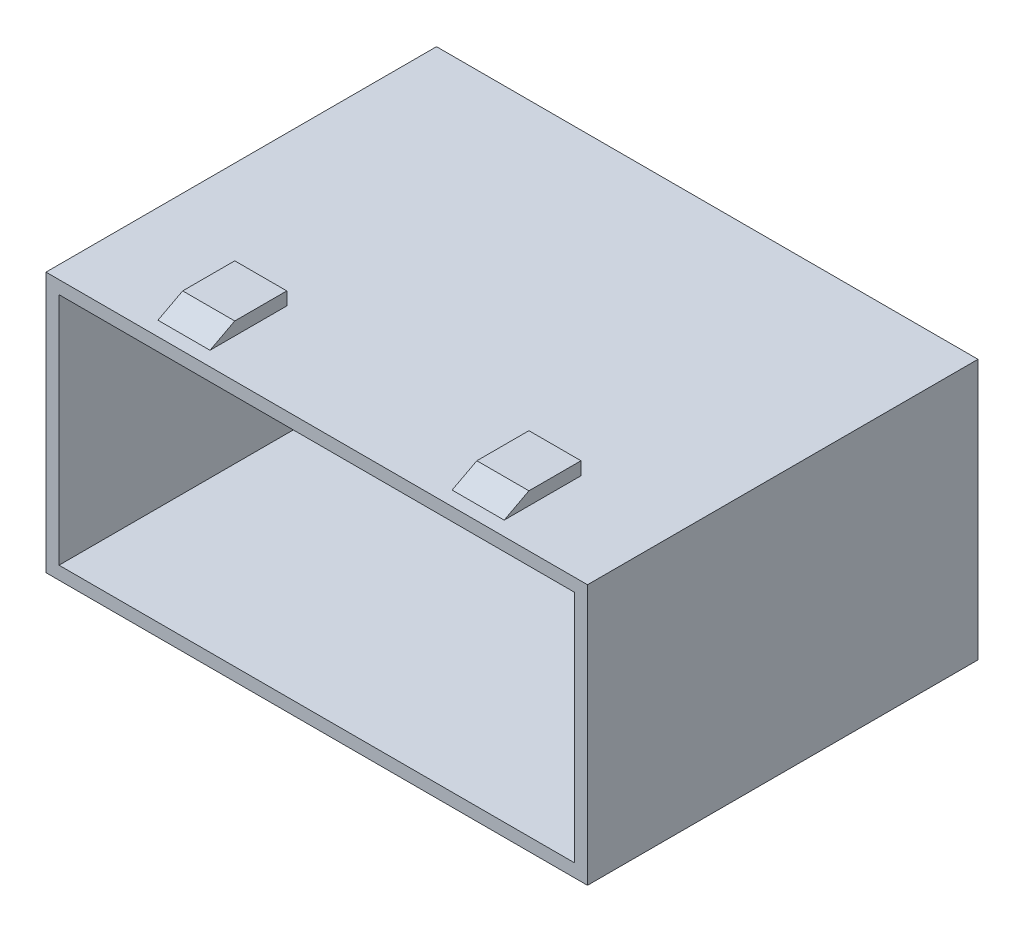
ISO-10303-21;
HEADER;
FILE_DESCRIPTION(('STEP AP214'),'2;1');
FILE_NAME('part.step','',(''),(''),'','','');
FILE_SCHEMA(('AUTOMOTIVE_DESIGN { 1 0 10303 214 1 1 1 1 }'));
ENDSEC;
DATA;
#1=APPLICATION_CONTEXT('core data for automotive mechanical design processes');
#2=APPLICATION_PROTOCOL_DEFINITION('international standard','automotive_design',2000,#1);
#3=PRODUCT_CONTEXT('',#1,'mechanical');
#4=PRODUCT('Part','Part','',(#3));
#5=PRODUCT_RELATED_PRODUCT_CATEGORY('part','',(#4));
#6=PRODUCT_DEFINITION_FORMATION('','',#4);
#7=PRODUCT_DEFINITION_CONTEXT('part definition',#1,'design');
#8=PRODUCT_DEFINITION('design','',#6,#7);
#9=PRODUCT_DEFINITION_SHAPE('','',#8);
#10=(LENGTH_UNIT() NAMED_UNIT(*) SI_UNIT(.MILLI.,.METRE.));
#11=(NAMED_UNIT(*) PLANE_ANGLE_UNIT() SI_UNIT($,.RADIAN.));
#12=(NAMED_UNIT(*) SI_UNIT($,.STERADIAN.) SOLID_ANGLE_UNIT());
#13=UNCERTAINTY_MEASURE_WITH_UNIT(LENGTH_MEASURE(1.E-05),#10,'distance_accuracy_value','');
#14=(GEOMETRIC_REPRESENTATION_CONTEXT(3) GLOBAL_UNCERTAINTY_ASSIGNED_CONTEXT((#13)) GLOBAL_UNIT_ASSIGNED_CONTEXT((#10,
#11,#12)) REPRESENTATION_CONTEXT('',''));
#15=CARTESIAN_POINT('',(0.,0.,0.));
#16=DIRECTION('',(0.,0.,1.));
#17=DIRECTION('',(1.,0.,0.));
#18=AXIS2_PLACEMENT_3D('',#15,#16,#17);
#19=CARTESIAN_POINT('',(13.3,11.,0.));
#20=DIRECTION('',(-1.,0.,0.));
#21=DIRECTION('',(0.,0.,1.));
#22=AXIS2_PLACEMENT_3D('',#19,#20,#21);
#23=PLANE('',#22);
#24=DIRECTION('',(0.,0.,-1.));
#25=VECTOR('',#24,1.);
#26=CARTESIAN_POINT('',(13.3,10.,0.));
#27=LINE('',#26,#25);
#28=CARTESIAN_POINT('',(13.3,10.,8.90014924755403));
#29=VERTEX_POINT('',#28);
#30=CARTESIAN_POINT('',(13.3,10.,3.00000000000001));
#31=VERTEX_POINT('',#30);
#32=EDGE_CURVE('E39',#29,#31,#27,.T.);
#33=ORIENTED_EDGE('',*,*,#32,.T.);
#34=DIRECTION('',(0.,-1.,0.));
#35=VECTOR('',#34,1.);
#36=CARTESIAN_POINT('',(13.3,0.,3.00000000000001));
#37=LINE('',#36,#35);
#38=CARTESIAN_POINT('',(13.3,11.,3.00000000000001));
#39=VERTEX_POINT('',#38);
#40=EDGE_CURVE('E53',#39,#31,#37,.T.);
#41=ORIENTED_EDGE('',*,*,#40,.F.);
#42=DIRECTION('',(0.,0.,-1.));
#43=VECTOR('',#42,1.);
#44=CARTESIAN_POINT('',(13.3,11.,0.));
#45=LINE('',#44,#43);
#46=CARTESIAN_POINT('',(13.3,11.,6.99999999999999));
#47=VERTEX_POINT('',#46);
#48=EDGE_CURVE('E281',#47,#39,#45,.T.);
#49=ORIENTED_EDGE('',*,*,#48,.F.);
#50=DIRECTION('',(0.,-0.465717785352861,0.884933299410767));
#51=VECTOR('',#50,1.);
#52=CARTESIAN_POINT('',(13.3,11.4990806231724,6.05167232941022));
#53=LINE('',#52,#51);
#54=EDGE_CURVE('E61',#47,#29,#53,.T.);
#55=ORIENTED_EDGE('',*,*,#54,.T.);
#56=EDGE_LOOP('',(#33,#41,#49,#55));
#57=FACE_BOUND('',#56,.T.);
#58=ADVANCED_FACE('F35',(#57),#23,.F.);
#59=CARTESIAN_POINT('',(9.3,11.,0.));
#60=DIRECTION('',(-1.,0.,0.));
#61=DIRECTION('',(0.,0.,1.));
#62=AXIS2_PLACEMENT_3D('',#59,#60,#61);
#63=PLANE('',#62);
#64=DIRECTION('',(0.,1.,0.));
#65=VECTOR('',#64,1.);
#66=CARTESIAN_POINT('',(9.3,11.,3.00000000000001));
#67=LINE('',#66,#65);
#68=CARTESIAN_POINT('',(9.3,10.,3.00000000000001));
#69=VERTEX_POINT('',#68);
#70=CARTESIAN_POINT('',(9.3,11.,3.00000000000001));
#71=VERTEX_POINT('',#70);
#72=EDGE_CURVE('E253',#69,#71,#67,.T.);
#73=ORIENTED_EDGE('',*,*,#72,.F.);
#74=DIRECTION('',(0.,0.,-1.));
#75=VECTOR('',#74,1.);
#76=CARTESIAN_POINT('',(9.3,10.,0.));
#77=LINE('',#76,#75);
#78=CARTESIAN_POINT('',(9.3,10.,8.90014924755403));
#79=VERTEX_POINT('',#78);
#80=EDGE_CURVE('E285',#79,#69,#77,.T.);
#81=ORIENTED_EDGE('',*,*,#80,.F.);
#82=DIRECTION('',(0.,0.465717785352861,-0.884933299410767));
#83=VECTOR('',#82,1.);
#84=CARTESIAN_POINT('',(9.3,13.8849042347061,1.51825138915781));
#85=LINE('',#84,#83);
#86=CARTESIAN_POINT('',(9.3,11.,6.99999999999999));
#87=VERTEX_POINT('',#86);
#88=EDGE_CURVE('E266',#79,#87,#85,.T.);
#89=ORIENTED_EDGE('',*,*,#88,.T.);
#90=DIRECTION('',(0.,0.,-1.));
#91=VECTOR('',#90,1.);
#92=CARTESIAN_POINT('',(9.3,11.,0.));
#93=LINE('',#92,#91);
#94=EDGE_CURVE('E284',#87,#71,#93,.T.);
#95=ORIENTED_EDGE('',*,*,#94,.T.);
#96=EDGE_LOOP('',(#73,#81,#89,#95));
#97=FACE_BOUND('',#96,.T.);
#98=ADVANCED_FACE('F447',(#97),#63,.T.);
#99=CARTESIAN_POINT('',(0.,11.,0.));
#100=DIRECTION('',(0.,1.,0.));
#101=DIRECTION('',(0.,0.,1.));
#102=AXIS2_PLACEMENT_3D('',#99,#100,#101);
#103=PLANE('',#102);
#104=DIRECTION('',(1.,0.,0.));
#105=VECTOR('',#104,1.);
#106=CARTESIAN_POINT('',(-13.7,11.,3.00000000000001));
#107=LINE('',#106,#105);
#108=EDGE_CURVE('E242',#71,#39,#107,.T.);
#109=ORIENTED_EDGE('',*,*,#108,.F.);
#110=ORIENTED_EDGE('',*,*,#94,.F.);
#111=DIRECTION('',(1.,0.,0.));
#112=VECTOR('',#111,1.);
#113=CARTESIAN_POINT('',(-13.7,11.,6.99999999999999));
#114=LINE('',#113,#112);
#115=EDGE_CURVE('E256',#87,#47,#114,.T.);
#116=ORIENTED_EDGE('',*,*,#115,.T.);
#117=ORIENTED_EDGE('',*,*,#48,.T.);
#118=EDGE_LOOP('',(#109,#110,#116,#117));
#119=FACE_BOUND('',#118,.T.);
#120=ADVANCED_FACE('F452',(#119),#103,.T.);
#121=CARTESIAN_POINT('',(-13.3,11.,0.));
#122=DIRECTION('',(-1.,0.,0.));
#123=DIRECTION('',(0.,0.,1.));
#124=AXIS2_PLACEMENT_3D('',#121,#122,#123);
#125=PLANE('',#124);
#126=DIRECTION('',(0.,1.,0.));
#127=VECTOR('',#126,1.);
#128=CARTESIAN_POINT('',(-13.3,11.,3.00000000000001));
#129=LINE('',#128,#127);
#130=CARTESIAN_POINT('',(-13.3,10.,3.00000000000001));
#131=VERTEX_POINT('',#130);
#132=CARTESIAN_POINT('',(-13.3,11.,3.00000000000001));
#133=VERTEX_POINT('',#132);
#134=EDGE_CURVE('E251',#131,#133,#129,.T.);
#135=ORIENTED_EDGE('',*,*,#134,.F.);
#136=DIRECTION('',(0.,0.,-1.));
#137=VECTOR('',#136,1.);
#138=CARTESIAN_POINT('',(-13.3,10.,0.));
#139=LINE('',#138,#137);
#140=CARTESIAN_POINT('',(-13.3,10.,8.90014924755403));
#141=VERTEX_POINT('',#140);
#142=EDGE_CURVE('E269',#141,#131,#139,.T.);
#143=ORIENTED_EDGE('',*,*,#142,.F.);
#144=DIRECTION('',(0.,0.465717785352861,-0.884933299410767));
#145=VECTOR('',#144,1.);
#146=CARTESIAN_POINT('',(-13.3,13.8849042347061,1.51825138915781));
#147=LINE('',#146,#145);
#148=CARTESIAN_POINT('',(-13.3,11.,6.99999999999999));
#149=VERTEX_POINT('',#148);
#150=EDGE_CURVE('E263',#141,#149,#147,.T.);
#151=ORIENTED_EDGE('',*,*,#150,.T.);
#152=DIRECTION('',(0.,0.,-1.));
#153=VECTOR('',#152,1.);
#154=CARTESIAN_POINT('',(-13.3,11.,0.));
#155=LINE('',#154,#153);
#156=EDGE_CURVE('E270',#149,#133,#155,.T.);
#157=ORIENTED_EDGE('',*,*,#156,.T.);
#158=EDGE_LOOP('',(#135,#143,#151,#157));
#159=FACE_BOUND('',#158,.T.);
#160=ADVANCED_FACE('F459',(#159),#125,.T.);
#161=CARTESIAN_POINT('',(-9.3,11.,0.));
#162=DIRECTION('',(-1.,0.,0.));
#163=DIRECTION('',(0.,0.,1.));
#164=AXIS2_PLACEMENT_3D('',#161,#162,#163);
#165=PLANE('',#164);
#166=DIRECTION('',(0.,0.,-1.));
#167=VECTOR('',#166,1.);
#168=CARTESIAN_POINT('',(-9.3,10.,0.));
#169=LINE('',#168,#167);
#170=CARTESIAN_POINT('',(-9.3,10.,8.90014924755403));
#171=VERTEX_POINT('',#170);
#172=CARTESIAN_POINT('',(-9.3,10.,3.00000000000001));
#173=VERTEX_POINT('',#172);
#174=EDGE_CURVE('E274',#171,#173,#169,.T.);
#175=ORIENTED_EDGE('',*,*,#174,.T.);
#176=DIRECTION('',(0.,1.,0.));
#177=VECTOR('',#176,1.);
#178=CARTESIAN_POINT('',(-9.3,11.,3.00000000000001));
#179=LINE('',#178,#177);
#180=CARTESIAN_POINT('',(-9.3,11.,3.00000000000001));
#181=VERTEX_POINT('',#180);
#182=EDGE_CURVE('E248',#173,#181,#179,.T.);
#183=ORIENTED_EDGE('',*,*,#182,.T.);
#184=DIRECTION('',(0.,0.,-1.));
#185=VECTOR('',#184,1.);
#186=CARTESIAN_POINT('',(-9.3,11.,0.));
#187=LINE('',#186,#185);
#188=CARTESIAN_POINT('',(-9.3,11.,6.99999999999999));
#189=VERTEX_POINT('',#188);
#190=EDGE_CURVE('E273',#189,#181,#187,.T.);
#191=ORIENTED_EDGE('',*,*,#190,.F.);
#192=DIRECTION('',(0.,0.465717785352861,-0.884933299410767));
#193=VECTOR('',#192,1.);
#194=CARTESIAN_POINT('',(-9.3,13.8849042347061,1.51825138915781));
#195=LINE('',#194,#193);
#196=EDGE_CURVE('E261',#171,#189,#195,.T.);
#197=ORIENTED_EDGE('',*,*,#196,.F.);
#198=EDGE_LOOP('',(#175,#183,#191,#197));
#199=FACE_BOUND('',#198,.T.);
#200=ADVANCED_FACE('F463',(#199),#165,.F.);
#201=CARTESIAN_POINT('',(0.,11.,0.));
#202=DIRECTION('',(0.,1.,0.));
#203=DIRECTION('',(0.,0.,1.));
#204=AXIS2_PLACEMENT_3D('',#201,#202,#203);
#205=PLANE('',#204);
#206=EDGE_CURVE('E246',#133,#181,#107,.T.);
#207=ORIENTED_EDGE('',*,*,#206,.F.);
#208=ORIENTED_EDGE('',*,*,#156,.F.);
#209=DIRECTION('',(1.,0.,0.));
#210=VECTOR('',#209,1.);
#211=CARTESIAN_POINT('',(0.,11.,6.99999999999999));
#212=LINE('',#211,#210);
#213=EDGE_CURVE('E11',#149,#189,#212,.T.);
#214=ORIENTED_EDGE('',*,*,#213,.T.);
#215=ORIENTED_EDGE('',*,*,#190,.T.);
#216=EDGE_LOOP('',(#207,#208,#214,#215));
#217=FACE_BOUND('',#216,.T.);
#218=ADVANCED_FACE('F467',(#217),#205,.T.);
#219=CARTESIAN_POINT('',(-13.3,-11.,0.));
#220=DIRECTION('',(1.,0.,0.));
#221=DIRECTION('',(0.,0.,-1.));
#222=AXIS2_PLACEMENT_3D('',#219,#220,#221);
#223=PLANE('',#222);
#224=DIRECTION('',(0.,-1.,0.));
#225=VECTOR('',#224,1.);
#226=CARTESIAN_POINT('',(-13.3,0.,3.));
#227=LINE('',#226,#225);
#228=CARTESIAN_POINT('',(-13.3,-10.,3.));
#229=VERTEX_POINT('',#228);
#230=CARTESIAN_POINT('',(-13.3,-11.,3.));
#231=VERTEX_POINT('',#230);
#232=EDGE_CURVE('E287',#229,#231,#227,.T.);
#233=ORIENTED_EDGE('',*,*,#232,.T.);
#234=DIRECTION('',(0.,0.,-1.));
#235=VECTOR('',#234,1.);
#236=CARTESIAN_POINT('',(-13.3,-11.,0.));
#237=LINE('',#236,#235);
#238=CARTESIAN_POINT('',(-13.3,-11.,6.99999999999999));
#239=VERTEX_POINT('',#238);
#240=EDGE_CURVE('E319',#239,#231,#237,.T.);
#241=ORIENTED_EDGE('',*,*,#240,.F.);
#242=DIRECTION('',(0.,0.465717785352861,0.884933299410767));
#243=VECTOR('',#242,1.);
#244=CARTESIAN_POINT('',(-13.3,-11.4990806231724,6.05167232941023));
#245=LINE('',#244,#243);
#246=CARTESIAN_POINT('',(-13.3,-10.,8.90014924755402));
#247=VERTEX_POINT('',#246);
#248=EDGE_CURVE('E413',#239,#247,#245,.T.);
#249=ORIENTED_EDGE('',*,*,#248,.T.);
#250=DIRECTION('',(0.,0.,-1.));
#251=VECTOR('',#250,1.);
#252=CARTESIAN_POINT('',(-13.3,-10.,0.));
#253=LINE('',#252,#251);
#254=EDGE_CURVE('E299',#247,#229,#253,.T.);
#255=ORIENTED_EDGE('',*,*,#254,.T.);
#256=EDGE_LOOP('',(#233,#241,#249,#255));
#257=FACE_BOUND('',#256,.T.);
#258=ADVANCED_FACE('F430',(#257),#223,.F.);
#259=CARTESIAN_POINT('',(-9.3,-11.,0.));
#260=DIRECTION('',(1.,0.,0.));
#261=DIRECTION('',(0.,0.,-1.));
#262=AXIS2_PLACEMENT_3D('',#259,#260,#261);
#263=PLANE('',#262);
#264=DIRECTION('',(0.,0.,-1.));
#265=VECTOR('',#264,1.);
#266=CARTESIAN_POINT('',(-9.3,-11.,0.));
#267=LINE('',#266,#265);
#268=CARTESIAN_POINT('',(-9.3,-11.,6.99999999999999));
#269=VERTEX_POINT('',#268);
#270=CARTESIAN_POINT('',(-9.3,-11.,3.));
#271=VERTEX_POINT('',#270);
#272=EDGE_CURVE('E327',#269,#271,#267,.T.);
#273=ORIENTED_EDGE('',*,*,#272,.T.);
#274=DIRECTION('',(0.,1.,0.));
#275=VECTOR('',#274,1.);
#276=CARTESIAN_POINT('',(-9.3,-11.,3.));
#277=LINE('',#276,#275);
#278=CARTESIAN_POINT('',(-9.3,-10.,3.));
#279=VERTEX_POINT('',#278);
#280=EDGE_CURVE('E394',#271,#279,#277,.T.);
#281=ORIENTED_EDGE('',*,*,#280,.T.);
#282=DIRECTION('',(0.,0.,-1.));
#283=VECTOR('',#282,1.);
#284=CARTESIAN_POINT('',(-9.3,-10.,0.));
#285=LINE('',#284,#283);
#286=CARTESIAN_POINT('',(-9.30000000000001,-10.,8.90014924755402));
#287=VERTEX_POINT('',#286);
#288=EDGE_CURVE('E316',#287,#279,#285,.T.);
#289=ORIENTED_EDGE('',*,*,#288,.F.);
#290=DIRECTION('',(0.,-0.465717785352861,-0.884933299410767));
#291=VECTOR('',#290,1.);
#292=CARTESIAN_POINT('',(-9.3,-13.8849042347061,1.51825138915782));
#293=LINE('',#292,#291);
#294=EDGE_CURVE('E377',#287,#269,#293,.T.);
#295=ORIENTED_EDGE('',*,*,#294,.T.);
#296=EDGE_LOOP('',(#273,#281,#289,#295));
#297=FACE_BOUND('',#296,.T.);
#298=ADVANCED_FACE('F393',(#297),#263,.T.);
#299=CARTESIAN_POINT('',(0.,-11.,0.));
#300=DIRECTION('',(0.,-1.,0.));
#301=DIRECTION('',(0.,0.,-1.));
#302=AXIS2_PLACEMENT_3D('',#299,#300,#301);
#303=PLANE('',#302);
#304=ORIENTED_EDGE('',*,*,#240,.T.);
#305=DIRECTION('',(-1.,0.,0.));
#306=VECTOR('',#305,1.);
#307=CARTESIAN_POINT('',(13.7,-11.,3.00000000000001));
#308=LINE('',#307,#306);
#309=EDGE_CURVE('E401',#271,#231,#308,.T.);
#310=ORIENTED_EDGE('',*,*,#309,.F.);
#311=ORIENTED_EDGE('',*,*,#272,.F.);
#312=DIRECTION('',(-1.,0.,0.));
#313=VECTOR('',#312,1.);
#314=CARTESIAN_POINT('',(13.7,-11.,6.99999999999999));
#315=LINE('',#314,#313);
#316=EDGE_CURVE('E399',#269,#239,#315,.T.);
#317=ORIENTED_EDGE('',*,*,#316,.T.);
#318=EDGE_LOOP('',(#304,#310,#311,#317));
#319=FACE_BOUND('',#318,.T.);
#320=ADVANCED_FACE('F398',(#319),#303,.T.);
#321=CARTESIAN_POINT('',(13.3,-11.,0.));
#322=DIRECTION('',(1.,0.,0.));
#323=DIRECTION('',(0.,0.,-1.));
#324=AXIS2_PLACEMENT_3D('',#321,#322,#323);
#325=PLANE('',#324);
#326=DIRECTION('',(0.,0.,-1.));
#327=VECTOR('',#326,1.);
#328=CARTESIAN_POINT('',(13.3,-11.,0.));
#329=LINE('',#328,#327);
#330=CARTESIAN_POINT('',(13.3,-11.,6.99999999999999));
#331=VERTEX_POINT('',#330);
#332=CARTESIAN_POINT('',(13.3,-11.,3.00000000000001));
#333=VERTEX_POINT('',#332);
#334=EDGE_CURVE('E379',#331,#333,#329,.T.);
#335=ORIENTED_EDGE('',*,*,#334,.T.);
#336=DIRECTION('',(0.,1.,0.));
#337=VECTOR('',#336,1.);
#338=CARTESIAN_POINT('',(13.3,-11.,3.00000000000001));
#339=LINE('',#338,#337);
#340=CARTESIAN_POINT('',(13.3,-10.,3.00000000000001));
#341=VERTEX_POINT('',#340);
#342=EDGE_CURVE('E410',#333,#341,#339,.T.);
#343=ORIENTED_EDGE('',*,*,#342,.T.);
#344=DIRECTION('',(0.,0.,-1.));
#345=VECTOR('',#344,1.);
#346=CARTESIAN_POINT('',(13.3,-10.,0.));
#347=LINE('',#346,#345);
#348=CARTESIAN_POINT('',(13.3,-10.,8.90014924755403));
#349=VERTEX_POINT('',#348);
#350=EDGE_CURVE('E368',#349,#341,#347,.T.);
#351=ORIENTED_EDGE('',*,*,#350,.F.);
#352=DIRECTION('',(0.,-0.465717785352861,-0.884933299410767));
#353=VECTOR('',#352,1.);
#354=CARTESIAN_POINT('',(13.3,-13.8849042347061,1.51825138915782));
#355=LINE('',#354,#353);
#356=EDGE_CURVE('E382',#349,#331,#355,.T.);
#357=ORIENTED_EDGE('',*,*,#356,.T.);
#358=EDGE_LOOP('',(#335,#343,#351,#357));
#359=FACE_BOUND('',#358,.T.);
#360=ADVANCED_FACE('F531',(#359),#325,.T.);
#361=CARTESIAN_POINT('',(9.3,-11.,0.));
#362=DIRECTION('',(1.,0.,0.));
#363=DIRECTION('',(0.,0.,-1.));
#364=AXIS2_PLACEMENT_3D('',#361,#362,#363);
#365=PLANE('',#364);
#366=DIRECTION('',(0.,1.,0.));
#367=VECTOR('',#366,1.);
#368=CARTESIAN_POINT('',(9.3,-11.,3.00000000000001));
#369=LINE('',#368,#367);
#370=CARTESIAN_POINT('',(9.3,-11.,3.00000000000001));
#371=VERTEX_POINT('',#370);
#372=CARTESIAN_POINT('',(9.3,-10.,3.00000000000001));
#373=VERTEX_POINT('',#372);
#374=EDGE_CURVE('E405',#371,#373,#369,.T.);
#375=ORIENTED_EDGE('',*,*,#374,.F.);
#376=DIRECTION('',(0.,0.,-1.));
#377=VECTOR('',#376,1.);
#378=CARTESIAN_POINT('',(9.3,-11.,0.));
#379=LINE('',#378,#377);
#380=CARTESIAN_POINT('',(9.3,-11.,7.));
#381=VERTEX_POINT('',#380);
#382=EDGE_CURVE('E385',#381,#371,#379,.T.);
#383=ORIENTED_EDGE('',*,*,#382,.F.);
#384=DIRECTION('',(0.,-0.465717785352861,-0.884933299410767));
#385=VECTOR('',#384,1.);
#386=CARTESIAN_POINT('',(9.3,-13.8849042347061,1.51825138915782));
#387=LINE('',#386,#385);
#388=CARTESIAN_POINT('',(9.3,-10.,8.90014924755402));
#389=VERTEX_POINT('',#388);
#390=EDGE_CURVE('E419',#389,#381,#387,.T.);
#391=ORIENTED_EDGE('',*,*,#390,.F.);
#392=DIRECTION('',(0.,0.,-1.));
#393=VECTOR('',#392,1.);
#394=CARTESIAN_POINT('',(9.3,-10.,0.));
#395=LINE('',#394,#393);
#396=EDGE_CURVE('E376',#389,#373,#395,.T.);
#397=ORIENTED_EDGE('',*,*,#396,.T.);
#398=EDGE_LOOP('',(#375,#383,#391,#397));
#399=FACE_BOUND('',#398,.T.);
#400=ADVANCED_FACE('F534',(#399),#365,.F.);
#401=CARTESIAN_POINT('',(0.,-11.,0.));
#402=DIRECTION('',(0.,-1.,0.));
#403=DIRECTION('',(0.,0.,-1.));
#404=AXIS2_PLACEMENT_3D('',#401,#402,#403);
#405=PLANE('',#404);
#406=ORIENTED_EDGE('',*,*,#382,.T.);
#407=EDGE_CURVE('E404',#333,#371,#308,.T.);
#408=ORIENTED_EDGE('',*,*,#407,.F.);
#409=ORIENTED_EDGE('',*,*,#334,.F.);
#410=DIRECTION('',(-1.,0.,0.));
#411=VECTOR('',#410,1.);
#412=CARTESIAN_POINT('',(0.,-11.,7.));
#413=LINE('',#412,#411);
#414=EDGE_CURVE('E45',#331,#381,#413,.T.);
#415=ORIENTED_EDGE('',*,*,#414,.T.);
#416=EDGE_LOOP('',(#406,#408,#409,#415));
#417=FACE_BOUND('',#416,.T.);
#418=ADVANCED_FACE('F511',(#417),#405,.T.);
#419=CARTESIAN_POINT('',(0.,0.,10.));
#420=DIRECTION('',(0.,0.,1.));
#421=DIRECTION('',(1.,0.,0.));
#422=AXIS2_PLACEMENT_3D('',#419,#420,#421);
#423=PLANE('',#422);
#424=DIRECTION('',(-1.,0.,0.));
#425=VECTOR('',#424,1.);
#426=CARTESIAN_POINT('',(-20.8,10.,10.));
#427=LINE('',#426,#425);
#428=CARTESIAN_POINT('',(20.8,10.,10.));
#429=VERTEX_POINT('',#428);
#430=CARTESIAN_POINT('',(-20.8,10.,10.));
#431=VERTEX_POINT('',#430);
#432=EDGE_CURVE('E295',#429,#431,#427,.T.);
#433=ORIENTED_EDGE('',*,*,#432,.T.);
#434=DIRECTION('',(0.,-1.,0.));
#435=VECTOR('',#434,1.);
#436=CARTESIAN_POINT('',(-20.8,10.,10.));
#437=LINE('',#436,#435);
#438=CARTESIAN_POINT('',(-20.8,-10.,10.));
#439=VERTEX_POINT('',#438);
#440=EDGE_CURVE('E206',#431,#439,#437,.T.);
#441=ORIENTED_EDGE('',*,*,#440,.T.);
#442=DIRECTION('',(1.,0.,0.));
#443=VECTOR('',#442,1.);
#444=CARTESIAN_POINT('',(-20.8,-10.,10.));
#445=LINE('',#444,#443);
#446=CARTESIAN_POINT('',(20.8,-10.,10.));
#447=VERTEX_POINT('',#446);
#448=EDGE_CURVE('E307',#439,#447,#445,.T.);
#449=ORIENTED_EDGE('',*,*,#448,.T.);
#450=DIRECTION('',(0.,1.,0.));
#451=VECTOR('',#450,1.);
#452=CARTESIAN_POINT('',(20.8,10.,10.));
#453=LINE('',#452,#451);
#454=EDGE_CURVE('E298',#447,#429,#453,.T.);
#455=ORIENTED_EDGE('',*,*,#454,.T.);
#456=EDGE_LOOP('',(#433,#441,#449,#455));
#457=FACE_BOUND('',#456,.T.);
#458=DIRECTION('',(0.,-1.,0.));
#459=VECTOR('',#458,1.);
#460=CARTESIAN_POINT('',(-19.8,9.,10.));
#461=LINE('',#460,#459);
#462=CARTESIAN_POINT('',(-19.8,9.,10.));
#463=VERTEX_POINT('',#462);
#464=CARTESIAN_POINT('',(-19.8,-9.,10.));
#465=VERTEX_POINT('',#464);
#466=EDGE_CURVE('E326',#463,#465,#461,.T.);
#467=ORIENTED_EDGE('',*,*,#466,.F.);
#468=DIRECTION('',(-1.,0.,0.));
#469=VECTOR('',#468,1.);
#470=CARTESIAN_POINT('',(-19.8,9.,10.));
#471=LINE('',#470,#469);
#472=CARTESIAN_POINT('',(19.8,9.,10.));
#473=VERTEX_POINT('',#472);
#474=EDGE_CURVE('E324',#473,#463,#471,.T.);
#475=ORIENTED_EDGE('',*,*,#474,.F.);
#476=DIRECTION('',(0.,1.,0.));
#477=VECTOR('',#476,1.);
#478=CARTESIAN_POINT('',(19.8,9.,10.));
#479=LINE('',#478,#477);
#480=CARTESIAN_POINT('',(19.8,-9.,10.));
#481=VERTEX_POINT('',#480);
#482=EDGE_CURVE('E332',#481,#473,#479,.T.);
#483=ORIENTED_EDGE('',*,*,#482,.F.);
#484=DIRECTION('',(1.,0.,0.));
#485=VECTOR('',#484,1.);
#486=CARTESIAN_POINT('',(-19.8,-9.,10.));
#487=LINE('',#486,#485);
#488=EDGE_CURVE('E329',#465,#481,#487,.T.);
#489=ORIENTED_EDGE('',*,*,#488,.F.);
#490=EDGE_LOOP('',(#467,#475,#483,#489));
#491=FACE_BOUND('',#490,.T.);
#492=ADVANCED_FACE('F349',(#457,#491),#423,.T.);
#493=CARTESIAN_POINT('',(20.8,10.,10.));
#494=DIRECTION('',(-1.,0.,0.));
#495=DIRECTION('',(0.,-1.,0.));
#496=AXIS2_PLACEMENT_3D('',#493,#494,#495);
#497=PLANE('',#496);
#498=DIRECTION('',(0.,0.,-1.));
#499=VECTOR('',#498,1.);
#500=CARTESIAN_POINT('',(20.8,-10.,10.));
#501=LINE('',#500,#499);
#502=CARTESIAN_POINT('',(20.8,-10.,-20.));
#503=VERTEX_POINT('',#502);
#504=EDGE_CURVE('E310',#447,#503,#501,.T.);
#505=ORIENTED_EDGE('',*,*,#504,.T.);
#506=DIRECTION('',(0.,-1.,0.));
#507=VECTOR('',#506,1.);
#508=CARTESIAN_POINT('',(20.8,10.,-20.));
#509=LINE('',#508,#507);
#510=CARTESIAN_POINT('',(20.8,10.,-20.));
#511=VERTEX_POINT('',#510);
#512=EDGE_CURVE('E219',#511,#503,#509,.T.);
#513=ORIENTED_EDGE('',*,*,#512,.F.);
#514=DIRECTION('',(0.,0.,-1.));
#515=VECTOR('',#514,1.);
#516=CARTESIAN_POINT('',(20.8,10.,10.));
#517=LINE('',#516,#515);
#518=EDGE_CURVE('E208',#429,#511,#517,.T.);
#519=ORIENTED_EDGE('',*,*,#518,.F.);
#520=ORIENTED_EDGE('',*,*,#454,.F.);
#521=EDGE_LOOP('',(#505,#513,#519,#520));
#522=FACE_BOUND('',#521,.T.);
#523=ADVANCED_FACE('F37',(#522),#497,.F.);
#524=CARTESIAN_POINT('',(-20.8,10.,10.));
#525=DIRECTION('',(0.,-1.,0.));
#526=DIRECTION('',(0.,0.,-1.));
#527=AXIS2_PLACEMENT_3D('',#524,#525,#526);
#528=PLANE('',#527);
#529=ORIENTED_EDGE('',*,*,#518,.T.);
#530=DIRECTION('',(1.,0.,0.));
#531=VECTOR('',#530,1.);
#532=CARTESIAN_POINT('',(20.8,10.,-20.));
#533=LINE('',#532,#531);
#534=CARTESIAN_POINT('',(-20.8,10.,-20.));
#535=VERTEX_POINT('',#534);
#536=EDGE_CURVE('E212',#535,#511,#533,.T.);
#537=ORIENTED_EDGE('',*,*,#536,.F.);
#538=DIRECTION('',(0.,0.,-1.));
#539=VECTOR('',#538,1.);
#540=CARTESIAN_POINT('',(-20.8,10.,10.));
#541=LINE('',#540,#539);
#542=EDGE_CURVE('E200',#431,#535,#541,.T.);
#543=ORIENTED_EDGE('',*,*,#542,.F.);
#544=ORIENTED_EDGE('',*,*,#432,.F.);
#545=EDGE_LOOP('',(#529,#537,#543,#544));
#546=FACE_BOUND('',#545,.T.);
#547=ORIENTED_EDGE('',*,*,#80,.T.);
#548=DIRECTION('',(1.,0.,0.));
#549=VECTOR('',#548,1.);
#550=CARTESIAN_POINT('',(-13.7,10.,3.00000000000001));
#551=LINE('',#550,#549);
#552=EDGE_CURVE('E243',#69,#31,#551,.T.);
#553=ORIENTED_EDGE('',*,*,#552,.T.);
#554=ORIENTED_EDGE('',*,*,#32,.F.);
#555=DIRECTION('',(1.,0.,0.));
#556=VECTOR('',#555,1.);
#557=CARTESIAN_POINT('',(-13.7,10.,8.90014924755403));
#558=LINE('',#557,#556);
#559=EDGE_CURVE('E257',#79,#29,#558,.T.);
#560=ORIENTED_EDGE('',*,*,#559,.F.);
#561=EDGE_LOOP('',(#547,#553,#554,#560));
#562=FACE_BOUND('',#561,.T.);
#563=ORIENTED_EDGE('',*,*,#142,.T.);
#564=EDGE_CURVE('E245',#131,#173,#551,.T.);
#565=ORIENTED_EDGE('',*,*,#564,.T.);
#566=ORIENTED_EDGE('',*,*,#174,.F.);
#567=EDGE_CURVE('E259',#141,#171,#558,.T.);
#568=ORIENTED_EDGE('',*,*,#567,.F.);
#569=EDGE_LOOP('',(#563,#565,#566,#568));
#570=FACE_BOUND('',#569,.T.);
#571=ADVANCED_FACE('F213',(#546,#562,#570),#528,.F.);
#572=CARTESIAN_POINT('',(-20.8,10.,10.));
#573=DIRECTION('',(1.,0.,0.));
#574=DIRECTION('',(0.,1.,0.));
#575=AXIS2_PLACEMENT_3D('',#572,#573,#574);
#576=PLANE('',#575);
#577=ORIENTED_EDGE('',*,*,#542,.T.);
#578=DIRECTION('',(0.,1.,0.));
#579=VECTOR('',#578,1.);
#580=CARTESIAN_POINT('',(-20.8,10.,-20.));
#581=LINE('',#580,#579);
#582=CARTESIAN_POINT('',(-20.8,-10.,-20.));
#583=VERTEX_POINT('',#582);
#584=EDGE_CURVE('E205',#583,#535,#581,.T.);
#585=ORIENTED_EDGE('',*,*,#584,.F.);
#586=DIRECTION('',(0.,0.,-1.));
#587=VECTOR('',#586,1.);
#588=CARTESIAN_POINT('',(-20.8,-10.,10.));
#589=LINE('',#588,#587);
#590=EDGE_CURVE('E209',#439,#583,#589,.T.);
#591=ORIENTED_EDGE('',*,*,#590,.F.);
#592=ORIENTED_EDGE('',*,*,#440,.F.);
#593=EDGE_LOOP('',(#577,#585,#591,#592));
#594=FACE_BOUND('',#593,.T.);
#595=ADVANCED_FACE('F202',(#594),#576,.F.);
#596=CARTESIAN_POINT('',(-20.8,-10.,10.));
#597=DIRECTION('',(0.,1.,0.));
#598=DIRECTION('',(0.,0.,1.));
#599=AXIS2_PLACEMENT_3D('',#596,#597,#598);
#600=PLANE('',#599);
#601=ORIENTED_EDGE('',*,*,#590,.T.);
#602=DIRECTION('',(-1.,0.,0.));
#603=VECTOR('',#602,1.);
#604=CARTESIAN_POINT('',(20.8,-10.,-20.));
#605=LINE('',#604,#603);
#606=EDGE_CURVE('E224',#503,#583,#605,.T.);
#607=ORIENTED_EDGE('',*,*,#606,.F.);
#608=ORIENTED_EDGE('',*,*,#504,.F.);
#609=ORIENTED_EDGE('',*,*,#448,.F.);
#610=EDGE_LOOP('',(#601,#607,#608,#609));
#611=FACE_BOUND('',#610,.T.);
#612=ORIENTED_EDGE('',*,*,#288,.T.);
#613=DIRECTION('',(-1.,0.,0.));
#614=VECTOR('',#613,1.);
#615=CARTESIAN_POINT('',(13.7,-10.,3.00000000000001));
#616=LINE('',#615,#614);
#617=EDGE_CURVE('E406',#279,#229,#616,.T.);
#618=ORIENTED_EDGE('',*,*,#617,.T.);
#619=ORIENTED_EDGE('',*,*,#254,.F.);
#620=DIRECTION('',(-1.,0.,0.));
#621=VECTOR('',#620,1.);
#622=CARTESIAN_POINT('',(13.7,-10.,8.90014924755403));
#623=LINE('',#622,#621);
#624=EDGE_CURVE('E416',#287,#247,#623,.T.);
#625=ORIENTED_EDGE('',*,*,#624,.F.);
#626=EDGE_LOOP('',(#612,#618,#619,#625));
#627=FACE_BOUND('',#626,.T.);
#628=ORIENTED_EDGE('',*,*,#350,.T.);
#629=EDGE_CURVE('E370',#341,#373,#616,.T.);
#630=ORIENTED_EDGE('',*,*,#629,.T.);
#631=ORIENTED_EDGE('',*,*,#396,.F.);
#632=EDGE_CURVE('E372',#349,#389,#623,.T.);
#633=ORIENTED_EDGE('',*,*,#632,.F.);
#634=EDGE_LOOP('',(#628,#630,#631,#633));
#635=FACE_BOUND('',#634,.T.);
#636=ADVANCED_FACE('F355',(#611,#627,#635),#600,.F.);
#637=CARTESIAN_POINT('',(-19.8,9.,10.));
#638=DIRECTION('',(0.,-1.,0.));
#639=DIRECTION('',(0.,0.,-1.));
#640=AXIS2_PLACEMENT_3D('',#637,#638,#639);
#641=PLANE('',#640);
#642=DIRECTION('',(0.,0.,-1.));
#643=VECTOR('',#642,1.);
#644=CARTESIAN_POINT('',(-19.8,9.,10.));
#645=LINE('',#644,#643);
#646=CARTESIAN_POINT('',(-19.8,9.,-19.));
#647=VERTEX_POINT('',#646);
#648=EDGE_CURVE('E342',#463,#647,#645,.T.);
#649=ORIENTED_EDGE('',*,*,#648,.T.);
#650=DIRECTION('',(1.,0.,0.));
#651=VECTOR('',#650,1.);
#652=CARTESIAN_POINT('',(19.8,9.,-19.));
#653=LINE('',#652,#651);
#654=CARTESIAN_POINT('',(19.8,9.,-19.));
#655=VERTEX_POINT('',#654);
#656=EDGE_CURVE('E232',#647,#655,#653,.T.);
#657=ORIENTED_EDGE('',*,*,#656,.T.);
#658=DIRECTION('',(0.,0.,-1.));
#659=VECTOR('',#658,1.);
#660=CARTESIAN_POINT('',(19.8,9.,10.));
#661=LINE('',#660,#659);
#662=EDGE_CURVE('E334',#473,#655,#661,.T.);
#663=ORIENTED_EDGE('',*,*,#662,.F.);
#664=ORIENTED_EDGE('',*,*,#474,.T.);
#665=EDGE_LOOP('',(#649,#657,#663,#664));
#666=FACE_BOUND('',#665,.T.);
#667=ADVANCED_FACE('F358',(#666),#641,.T.);
#668=CARTESIAN_POINT('',(-19.8,9.,10.));
#669=DIRECTION('',(1.,0.,0.));
#670=DIRECTION('',(0.,0.,-1.));
#671=AXIS2_PLACEMENT_3D('',#668,#669,#670);
#672=PLANE('',#671);
#673=DIRECTION('',(0.,0.,-1.));
#674=VECTOR('',#673,1.);
#675=CARTESIAN_POINT('',(-19.8,-9.,10.));
#676=LINE('',#675,#674);
#677=CARTESIAN_POINT('',(-19.8,-9.,-19.));
#678=VERTEX_POINT('',#677);
#679=EDGE_CURVE('E340',#465,#678,#676,.T.);
#680=ORIENTED_EDGE('',*,*,#679,.T.);
#681=DIRECTION('',(0.,1.,0.));
#682=VECTOR('',#681,1.);
#683=CARTESIAN_POINT('',(-19.8,9.,-19.));
#684=LINE('',#683,#682);
#685=EDGE_CURVE('E229',#678,#647,#684,.T.);
#686=ORIENTED_EDGE('',*,*,#685,.T.);
#687=ORIENTED_EDGE('',*,*,#648,.F.);
#688=ORIENTED_EDGE('',*,*,#466,.T.);
#689=EDGE_LOOP('',(#680,#686,#687,#688));
#690=FACE_BOUND('',#689,.T.);
#691=ADVANCED_FACE('F514',(#690),#672,.T.);
#692=CARTESIAN_POINT('',(-19.8,-9.,10.));
#693=DIRECTION('',(0.,1.,0.));
#694=DIRECTION('',(0.,0.,1.));
#695=AXIS2_PLACEMENT_3D('',#692,#693,#694);
#696=PLANE('',#695);
#697=DIRECTION('',(0.,0.,-1.));
#698=VECTOR('',#697,1.);
#699=CARTESIAN_POINT('',(19.8,-9.,10.));
#700=LINE('',#699,#698);
#701=CARTESIAN_POINT('',(19.8,-9.,-19.));
#702=VERTEX_POINT('',#701);
#703=EDGE_CURVE('E337',#481,#702,#700,.T.);
#704=ORIENTED_EDGE('',*,*,#703,.T.);
#705=DIRECTION('',(-1.,0.,0.));
#706=VECTOR('',#705,1.);
#707=CARTESIAN_POINT('',(19.8,-9.,-19.));
#708=LINE('',#707,#706);
#709=EDGE_CURVE('E238',#702,#678,#708,.T.);
#710=ORIENTED_EDGE('',*,*,#709,.T.);
#711=ORIENTED_EDGE('',*,*,#679,.F.);
#712=ORIENTED_EDGE('',*,*,#488,.T.);
#713=EDGE_LOOP('',(#704,#710,#711,#712));
#714=FACE_BOUND('',#713,.T.);
#715=ADVANCED_FACE('F517',(#714),#696,.T.);
#716=CARTESIAN_POINT('',(19.8,9.,10.));
#717=DIRECTION('',(-1.,0.,0.));
#718=DIRECTION('',(0.,-1.,0.));
#719=AXIS2_PLACEMENT_3D('',#716,#717,#718);
#720=PLANE('',#719);
#721=ORIENTED_EDGE('',*,*,#662,.T.);
#722=DIRECTION('',(0.,-1.,0.));
#723=VECTOR('',#722,1.);
#724=CARTESIAN_POINT('',(19.8,9.,-19.));
#725=LINE('',#724,#723);
#726=EDGE_CURVE('E235',#655,#702,#725,.T.);
#727=ORIENTED_EDGE('',*,*,#726,.T.);
#728=ORIENTED_EDGE('',*,*,#703,.F.);
#729=ORIENTED_EDGE('',*,*,#482,.T.);
#730=EDGE_LOOP('',(#721,#727,#728,#729));
#731=FACE_BOUND('',#730,.T.);
#732=ADVANCED_FACE('F521',(#731),#720,.T.);
#733=CARTESIAN_POINT('',(13.7,-11.4990806231724,6.05167232941024));
#734=DIRECTION('',(0.,-0.884933299410767,0.465717785352861));
#735=DIRECTION('',(0.,-0.465717785352861,-0.884933299410767));
#736=AXIS2_PLACEMENT_3D('',#733,#734,#735);
#737=PLANE('',#736);
#738=ORIENTED_EDGE('',*,*,#632,.T.);
#739=ORIENTED_EDGE('',*,*,#390,.T.);
#740=ORIENTED_EDGE('',*,*,#414,.F.);
#741=ORIENTED_EDGE('',*,*,#356,.F.);
#742=EDGE_LOOP('',(#738,#739,#740,#741));
#743=FACE_BOUND('',#742,.T.);
#744=ADVANCED_FACE('F442',(#743),#737,.T.);
#745=ORIENTED_EDGE('',*,*,#624,.T.);
#746=ORIENTED_EDGE('',*,*,#248,.F.);
#747=ORIENTED_EDGE('',*,*,#316,.F.);
#748=ORIENTED_EDGE('',*,*,#294,.F.);
#749=EDGE_LOOP('',(#745,#746,#747,#748));
#750=FACE_BOUND('',#749,.T.);
#751=ADVANCED_FACE('F434',(#750),#737,.T.);
#752=CARTESIAN_POINT('',(13.7,0.,3.00000000000001));
#753=DIRECTION('',(0.,0.,-1.));
#754=DIRECTION('',(-1.,0.,0.));
#755=AXIS2_PLACEMENT_3D('',#752,#753,#754);
#756=PLANE('',#755);
#757=ORIENTED_EDGE('',*,*,#309,.T.);
#758=ORIENTED_EDGE('',*,*,#232,.F.);
#759=ORIENTED_EDGE('',*,*,#617,.F.);
#760=ORIENTED_EDGE('',*,*,#280,.F.);
#761=EDGE_LOOP('',(#757,#758,#759,#760));
#762=FACE_BOUND('',#761,.T.);
#763=ADVANCED_FACE('F431',(#762),#756,.T.);
#764=ORIENTED_EDGE('',*,*,#407,.T.);
#765=ORIENTED_EDGE('',*,*,#374,.T.);
#766=ORIENTED_EDGE('',*,*,#629,.F.);
#767=ORIENTED_EDGE('',*,*,#342,.F.);
#768=EDGE_LOOP('',(#764,#765,#766,#767));
#769=FACE_BOUND('',#768,.T.);
#770=ADVANCED_FACE('F433',(#769),#756,.T.);
#771=CARTESIAN_POINT('',(-13.7,11.4990806231724,6.05167232941022));
#772=DIRECTION('',(0.,0.884933299410767,0.465717785352861));
#773=DIRECTION('',(0.,-0.465717785352861,0.884933299410767));
#774=AXIS2_PLACEMENT_3D('',#771,#772,#773);
#775=PLANE('',#774);
#776=ORIENTED_EDGE('',*,*,#567,.T.);
#777=ORIENTED_EDGE('',*,*,#196,.T.);
#778=ORIENTED_EDGE('',*,*,#213,.F.);
#779=ORIENTED_EDGE('',*,*,#150,.F.);
#780=EDGE_LOOP('',(#776,#777,#778,#779));
#781=FACE_BOUND('',#780,.T.);
#782=ADVANCED_FACE('F440',(#781),#775,.T.);
#783=ORIENTED_EDGE('',*,*,#559,.T.);
#784=ORIENTED_EDGE('',*,*,#54,.F.);
#785=ORIENTED_EDGE('',*,*,#115,.F.);
#786=ORIENTED_EDGE('',*,*,#88,.F.);
#787=EDGE_LOOP('',(#783,#784,#785,#786));
#788=FACE_BOUND('',#787,.T.);
#789=ADVANCED_FACE('F472',(#788),#775,.T.);
#790=CARTESIAN_POINT('',(-13.7,0.,3.00000000000001));
#791=DIRECTION('',(0.,0.,1.));
#792=DIRECTION('',(1.,0.,0.));
#793=AXIS2_PLACEMENT_3D('',#790,#791,#792);
#794=PLANE('',#793);
#795=ORIENTED_EDGE('',*,*,#72,.T.);
#796=ORIENTED_EDGE('',*,*,#108,.T.);
#797=ORIENTED_EDGE('',*,*,#40,.T.);
#798=ORIENTED_EDGE('',*,*,#552,.F.);
#799=EDGE_LOOP('',(#795,#796,#797,#798));
#800=FACE_BOUND('',#799,.T.);
#801=ADVANCED_FACE('F475',(#800),#794,.F.);
#802=ORIENTED_EDGE('',*,*,#134,.T.);
#803=ORIENTED_EDGE('',*,*,#206,.T.);
#804=ORIENTED_EDGE('',*,*,#182,.F.);
#805=ORIENTED_EDGE('',*,*,#564,.F.);
#806=EDGE_LOOP('',(#802,#803,#804,#805));
#807=FACE_BOUND('',#806,.T.);
#808=ADVANCED_FACE('F478',(#807),#794,.F.);
#809=CARTESIAN_POINT('',(0.,0.,-20.));
#810=DIRECTION('',(0.,0.,-1.));
#811=DIRECTION('',(-1.,0.,0.));
#812=AXIS2_PLACEMENT_3D('',#809,#810,#811);
#813=PLANE('',#812);
#814=ORIENTED_EDGE('',*,*,#584,.T.);
#815=ORIENTED_EDGE('',*,*,#536,.T.);
#816=ORIENTED_EDGE('',*,*,#512,.T.);
#817=ORIENTED_EDGE('',*,*,#606,.T.);
#818=EDGE_LOOP('',(#814,#815,#816,#817));
#819=FACE_BOUND('',#818,.T.);
#820=ADVANCED_FACE('F222',(#819),#813,.T.);
#821=CARTESIAN_POINT('',(0.,0.,-19.));
#822=DIRECTION('',(0.,0.,-1.));
#823=DIRECTION('',(-1.,0.,0.));
#824=AXIS2_PLACEMENT_3D('',#821,#822,#823);
#825=PLANE('',#824);
#826=ORIENTED_EDGE('',*,*,#656,.F.);
#827=ORIENTED_EDGE('',*,*,#685,.F.);
#828=ORIENTED_EDGE('',*,*,#709,.F.);
#829=ORIENTED_EDGE('',*,*,#726,.F.);
#830=EDGE_LOOP('',(#826,#827,#828,#829));
#831=FACE_BOUND('',#830,.T.);
#832=ADVANCED_FACE('F479',(#831),#825,.F.);
#833=CLOSED_SHELL('',(#58,#98,#120,#160,#200,#218,#258,#298,#320,#360,#400,#418,#492,#523,#571,
#595,#636,#667,#691,#715,#732,#744,#751,#763,#770,#782,#789,#801,#808,#820,#832));
#834=MANIFOLD_SOLID_BREP('B2',#833);
#835=ADVANCED_BREP_SHAPE_REPRESENTATION('',(#18,#834),#14);
#836=SHAPE_DEFINITION_REPRESENTATION(#9,#835);
ENDSEC;
END-ISO-10303-21;
